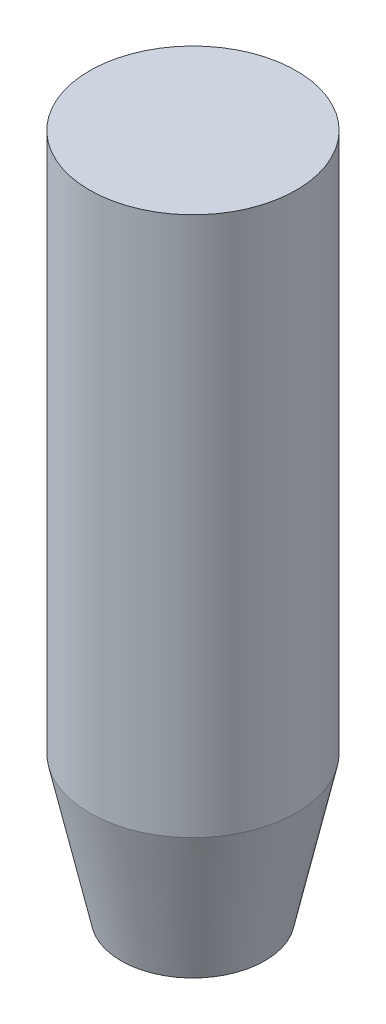
ISO-10303-21;
HEADER;
FILE_DESCRIPTION(('STEP AP214'),'2;1');
FILE_NAME('part.step','',(''),(''),'','','');
FILE_SCHEMA(('AUTOMOTIVE_DESIGN { 1 0 10303 214 1 1 1 1 }'));
ENDSEC;
DATA;
#1=APPLICATION_CONTEXT('core data for automotive mechanical design processes');
#2=APPLICATION_PROTOCOL_DEFINITION('international standard','automotive_design',2000,#1);
#3=PRODUCT_CONTEXT('',#1,'mechanical');
#4=PRODUCT('Part','Part','',(#3));
#5=PRODUCT_RELATED_PRODUCT_CATEGORY('part','',(#4));
#6=PRODUCT_DEFINITION_FORMATION('','',#4);
#7=PRODUCT_DEFINITION_CONTEXT('part definition',#1,'design');
#8=PRODUCT_DEFINITION('design','',#6,#7);
#9=PRODUCT_DEFINITION_SHAPE('','',#8);
#10=(LENGTH_UNIT() NAMED_UNIT(*) SI_UNIT(.MILLI.,.METRE.));
#11=(NAMED_UNIT(*) PLANE_ANGLE_UNIT() SI_UNIT($,.RADIAN.));
#12=(NAMED_UNIT(*) SI_UNIT($,.STERADIAN.) SOLID_ANGLE_UNIT());
#13=UNCERTAINTY_MEASURE_WITH_UNIT(LENGTH_MEASURE(1.E-05),#10,'distance_accuracy_value','');
#14=(GEOMETRIC_REPRESENTATION_CONTEXT(3) GLOBAL_UNCERTAINTY_ASSIGNED_CONTEXT((#13)) GLOBAL_UNIT_ASSIGNED_CONTEXT((#10,
#11,#12)) REPRESENTATION_CONTEXT('',''));
#15=CARTESIAN_POINT('',(0.,0.,0.));
#16=DIRECTION('',(0.,0.,1.));
#17=DIRECTION('',(1.,0.,0.));
#18=AXIS2_PLACEMENT_3D('',#15,#16,#17);
#19=CARTESIAN_POINT('',(0.,120.65,0.));
#20=DIRECTION('',(0.,-1.,0.));
#21=DIRECTION('',(0.,0.,-1.));
#22=AXIS2_PLACEMENT_3D('',#19,#20,#21);
#23=CYLINDRICAL_SURFACE('',#22,18.25625);
#24=CARTESIAN_POINT('',(0.,25.4000000000012,0.));
#25=DIRECTION('',(0.,1.,0.));
#26=DIRECTION('',(0.,0.,1.));
#27=AXIS2_PLACEMENT_3D('',#24,#25,#26);
#28=CIRCLE('',#27,18.25625);
#29=CARTESIAN_POINT('',(0.,25.4000000000012,18.25625));
#30=VERTEX_POINT('',#29);
#31=EDGE_CURVE('E37',#30,#30,#28,.T.);
#32=ORIENTED_EDGE('',*,*,#31,.T.);
#33=EDGE_LOOP('',(#32));
#34=FACE_BOUND('',#33,.T.);
#35=CARTESIAN_POINT('',(0.,120.65,0.));
#36=DIRECTION('',(0.,1.,0.));
#37=DIRECTION('',(0.,0.,1.));
#38=AXIS2_PLACEMENT_3D('',#35,#36,#37);
#39=CIRCLE('',#38,18.25625);
#40=CARTESIAN_POINT('',(0.,120.65,18.25625));
#41=VERTEX_POINT('',#40);
#42=EDGE_CURVE('E41',#41,#41,#39,.T.);
#43=ORIENTED_EDGE('',*,*,#42,.F.);
#44=EDGE_LOOP('',(#43));
#45=FACE_BOUND('',#44,.T.);
#46=ADVANCED_FACE('F30',(#34,#45),#23,.T.);
#47=CARTESIAN_POINT('',(0.,120.65,0.));
#48=DIRECTION('',(0.,1.,0.));
#49=DIRECTION('',(0.,0.,1.));
#50=AXIS2_PLACEMENT_3D('',#47,#48,#49);
#51=PLANE('',#50);
#52=ORIENTED_EDGE('',*,*,#42,.T.);
#53=EDGE_LOOP('',(#52));
#54=FACE_BOUND('',#53,.T.);
#55=ADVANCED_FACE('F48',(#54),#51,.T.);
#56=CARTESIAN_POINT('',(0.,0.,0.));
#57=DIRECTION('',(0.,1.,0.));
#58=DIRECTION('',(0.,0.,1.));
#59=AXIS2_PLACEMENT_3D('',#56,#57,#58);
#60=PLANE('',#59);
#61=CARTESIAN_POINT('',(0.,0.,0.));
#62=DIRECTION('',(0.,1.,0.));
#63=DIRECTION('',(0.,0.,1.));
#64=AXIS2_PLACEMENT_3D('',#61,#62,#63);
#65=CIRCLE('',#64,12.6999999999998);
#66=CARTESIAN_POINT('',(0.,0.,12.6999999999998));
#67=VERTEX_POINT('',#66);
#68=EDGE_CURVE('E10',#67,#67,#65,.F.);
#69=ORIENTED_EDGE('',*,*,#68,.T.);
#70=EDGE_LOOP('',(#69));
#71=FACE_BOUND('',#70,.T.);
#72=ADVANCED_FACE('F54',(#71),#60,.F.);
#73=CARTESIAN_POINT('',(0.,25.4000000000012,0.));
#74=DIRECTION('',(0.,1.,0.));
#75=DIRECTION('',(0.,0.,1.));
#76=AXIS2_PLACEMENT_3D('',#73,#74,#75);
#77=CONICAL_SURFACE('',#76,18.25625,0.215357699697737);
#78=ORIENTED_EDGE('',*,*,#68,.F.);
#79=EDGE_LOOP('',(#78));
#80=FACE_BOUND('',#79,.T.);
#81=ORIENTED_EDGE('',*,*,#31,.F.);
#82=EDGE_LOOP('',(#81));
#83=FACE_BOUND('',#82,.T.);
#84=ADVANCED_FACE('F32',(#80,#83),#77,.T.);
#85=CLOSED_SHELL('',(#46,#55,#72,#84));
#86=MANIFOLD_SOLID_BREP('B2',#85);
#87=ADVANCED_BREP_SHAPE_REPRESENTATION('',(#18,#86),#14);
#88=SHAPE_DEFINITION_REPRESENTATION(#9,#87);
ENDSEC;
END-ISO-10303-21;
